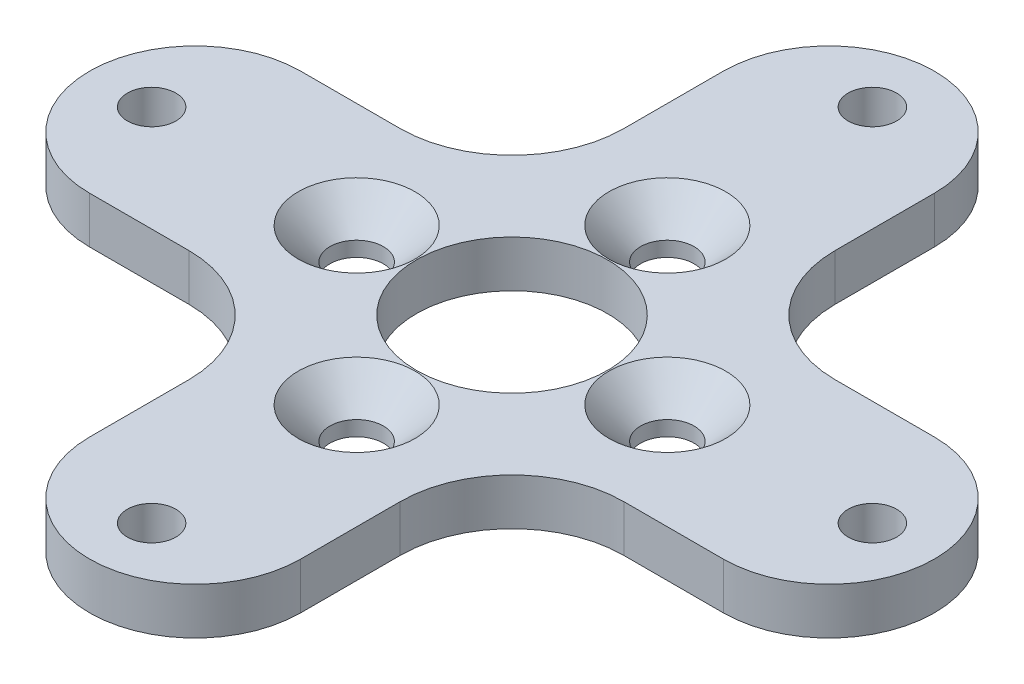
ISO-10303-21;
HEADER;
FILE_DESCRIPTION(('STEP AP214'),'2;1');
FILE_NAME('part.step','',(''),(''),'','','');
FILE_SCHEMA(('AUTOMOTIVE_DESIGN { 1 0 10303 214 1 1 1 1 }'));
ENDSEC;
DATA;
#1=APPLICATION_CONTEXT('core data for automotive mechanical design processes');
#2=APPLICATION_PROTOCOL_DEFINITION('international standard','automotive_design',2000,#1);
#3=PRODUCT_CONTEXT('',#1,'mechanical');
#4=PRODUCT('Part','Part','',(#3));
#5=PRODUCT_RELATED_PRODUCT_CATEGORY('part','',(#4));
#6=PRODUCT_DEFINITION_FORMATION('','',#4);
#7=PRODUCT_DEFINITION_CONTEXT('part definition',#1,'design');
#8=PRODUCT_DEFINITION('design','',#6,#7);
#9=PRODUCT_DEFINITION_SHAPE('','',#8);
#10=(LENGTH_UNIT() NAMED_UNIT(*) SI_UNIT(.MILLI.,.METRE.));
#11=(NAMED_UNIT(*) PLANE_ANGLE_UNIT() SI_UNIT($,.RADIAN.));
#12=(NAMED_UNIT(*) SI_UNIT($,.STERADIAN.) SOLID_ANGLE_UNIT());
#13=UNCERTAINTY_MEASURE_WITH_UNIT(LENGTH_MEASURE(1.E-05),#10,'distance_accuracy_value','');
#14=(GEOMETRIC_REPRESENTATION_CONTEXT(3) GLOBAL_UNCERTAINTY_ASSIGNED_CONTEXT((#13)) GLOBAL_UNIT_ASSIGNED_CONTEXT((#10,
#11,#12)) REPRESENTATION_CONTEXT('',''));
#15=CARTESIAN_POINT('',(0.,0.,0.));
#16=DIRECTION('',(0.,0.,1.));
#17=DIRECTION('',(1.,0.,0.));
#18=AXIS2_PLACEMENT_3D('',#15,#16,#17);
#19=CARTESIAN_POINT('',(0.,3.75,-25.5));
#20=DIRECTION('',(0.,1.,0.));
#21=DIRECTION('',(0.,0.,1.));
#22=AXIS2_PLACEMENT_3D('',#19,#20,#21);
#23=PLANE('',#22);
#24=CARTESIAN_POINT('',(12.5,3.75,0.));
#25=DIRECTION('',(0.,1.,0.));
#26=DIRECTION('',(0.,0.,1.));
#27=AXIS2_PLACEMENT_3D('',#24,#25,#26);
#28=CIRCLE('',#27,4.7);
#29=CARTESIAN_POINT('',(12.5,3.75,4.7));
#30=VERTEX_POINT('',#29);
#31=EDGE_CURVE('E606',#30,#30,#28,.T.);
#32=ORIENTED_EDGE('',*,*,#31,.F.);
#33=EDGE_LOOP('',(#32));
#34=FACE_BOUND('',#33,.T.);
#35=CARTESIAN_POINT('',(0.,3.75,-12.5));
#36=DIRECTION('',(0.,1.,0.));
#37=DIRECTION('',(0.,0.,1.));
#38=AXIS2_PLACEMENT_3D('',#35,#36,#37);
#39=CIRCLE('',#38,4.7);
#40=CARTESIAN_POINT('',(0.,3.75,-7.8));
#41=VERTEX_POINT('',#40);
#42=EDGE_CURVE('E613',#41,#41,#39,.T.);
#43=ORIENTED_EDGE('',*,*,#42,.F.);
#44=EDGE_LOOP('',(#43));
#45=FACE_BOUND('',#44,.T.);
#46=CARTESIAN_POINT('',(0.,3.75,12.5));
#47=DIRECTION('',(0.,1.,0.));
#48=DIRECTION('',(0.,0.,1.));
#49=AXIS2_PLACEMENT_3D('',#46,#47,#48);
#50=CIRCLE('',#49,4.7);
#51=CARTESIAN_POINT('',(0.,3.75,17.2));
#52=VERTEX_POINT('',#51);
#53=EDGE_CURVE('E622',#52,#52,#50,.T.);
#54=ORIENTED_EDGE('',*,*,#53,.F.);
#55=EDGE_LOOP('',(#54));
#56=FACE_BOUND('',#55,.T.);
#57=CARTESIAN_POINT('',(-12.5,3.75,0.));
#58=DIRECTION('',(0.,1.,0.));
#59=DIRECTION('',(0.,0.,1.));
#60=AXIS2_PLACEMENT_3D('',#57,#58,#59);
#61=CIRCLE('',#60,4.7);
#62=CARTESIAN_POINT('',(-12.5,3.75,4.7));
#63=VERTEX_POINT('',#62);
#64=EDGE_CURVE('E631',#63,#63,#61,.T.);
#65=ORIENTED_EDGE('',*,*,#64,.F.);
#66=EDGE_LOOP('',(#65));
#67=FACE_BOUND('',#66,.T.);
#68=CARTESIAN_POINT('',(1.64196851892795E-12,3.75,29.));
#69=DIRECTION('',(0.,1.,0.));
#70=DIRECTION('',(0.,0.,1.));
#71=AXIS2_PLACEMENT_3D('',#68,#69,#70);
#72=CIRCLE('',#71,1.95000000000176);
#73=CARTESIAN_POINT('',(1.64196851892795E-12,3.75,30.9500000000018));
#74=VERTEX_POINT('',#73);
#75=EDGE_CURVE('E647',#74,#74,#72,.T.);
#76=ORIENTED_EDGE('',*,*,#75,.F.);
#77=EDGE_LOOP('',(#76));
#78=FACE_BOUND('',#77,.T.);
#79=CARTESIAN_POINT('',(0.,3.75,-29.));
#80=DIRECTION('',(0.,1.,0.));
#81=DIRECTION('',(0.,0.,1.));
#82=AXIS2_PLACEMENT_3D('',#79,#80,#81);
#83=CIRCLE('',#82,1.95);
#84=CARTESIAN_POINT('',(0.,3.75,-27.05));
#85=VERTEX_POINT('',#84);
#86=EDGE_CURVE('E659',#85,#85,#83,.T.);
#87=ORIENTED_EDGE('',*,*,#86,.F.);
#88=EDGE_LOOP('',(#87));
#89=FACE_BOUND('',#88,.T.);
#90=DIRECTION('',(0.,0.,1.));
#91=VECTOR('',#90,1.);
#92=CARTESIAN_POINT('',(-8.49999999999999,3.75,-25.5));
#93=LINE('',#92,#91);
#94=CARTESIAN_POINT('',(-8.49999999999999,3.75,-25.5));
#95=VERTEX_POINT('',#94);
#96=CARTESIAN_POINT('',(-8.49999999999999,3.75,-17.5));
#97=VERTEX_POINT('',#96);
#98=EDGE_CURVE('E248',#95,#97,#93,.T.);
#99=ORIENTED_EDGE('',*,*,#98,.T.);
#100=CARTESIAN_POINT('',(-17.5,3.75,-17.5));
#101=DIRECTION('',(0.,1.,0.));
#102=DIRECTION('',(0.,0.,1.));
#103=AXIS2_PLACEMENT_3D('',#100,#101,#102);
#104=CIRCLE('',#103,9.);
#105=CARTESIAN_POINT('',(-17.5,3.75,-8.5));
#106=VERTEX_POINT('',#105);
#107=EDGE_CURVE('E11',#97,#106,#104,.F.);
#108=ORIENTED_EDGE('',*,*,#107,.T.);
#109=DIRECTION('',(-1.,0.,0.));
#110=VECTOR('',#109,1.);
#111=CARTESIAN_POINT('',(-25.5,3.75,-8.5));
#112=LINE('',#111,#110);
#113=CARTESIAN_POINT('',(-25.5,3.75,-8.5));
#114=VERTEX_POINT('',#113);
#115=EDGE_CURVE('E144',#106,#114,#112,.T.);
#116=ORIENTED_EDGE('',*,*,#115,.T.);
#117=CARTESIAN_POINT('',(-25.5,3.75,0.));
#118=DIRECTION('',(0.,1.,0.));
#119=DIRECTION('',(0.,0.,1.));
#120=AXIS2_PLACEMENT_3D('',#117,#118,#119);
#121=CIRCLE('',#120,8.5);
#122=CARTESIAN_POINT('',(-25.5,3.75,8.5));
#123=VERTEX_POINT('',#122);
#124=EDGE_CURVE('E148',#114,#123,#121,.T.);
#125=ORIENTED_EDGE('',*,*,#124,.T.);
#126=DIRECTION('',(1.,0.,0.));
#127=VECTOR('',#126,1.);
#128=CARTESIAN_POINT('',(-25.5,3.75,8.5));
#129=LINE('',#128,#127);
#130=CARTESIAN_POINT('',(-17.5,3.75,8.5));
#131=VERTEX_POINT('',#130);
#132=EDGE_CURVE('E164',#123,#131,#129,.T.);
#133=ORIENTED_EDGE('',*,*,#132,.T.);
#134=CARTESIAN_POINT('',(-17.5,3.75,17.5));
#135=DIRECTION('',(0.,1.,0.));
#136=DIRECTION('',(0.,0.,1.));
#137=AXIS2_PLACEMENT_3D('',#134,#135,#136);
#138=CIRCLE('',#137,9.);
#139=CARTESIAN_POINT('',(-8.49999999999999,3.75,17.5));
#140=VERTEX_POINT('',#139);
#141=EDGE_CURVE('E194',#131,#140,#138,.F.);
#142=ORIENTED_EDGE('',*,*,#141,.T.);
#143=DIRECTION('',(0.,0.,1.));
#144=VECTOR('',#143,1.);
#145=CARTESIAN_POINT('',(-8.49999999999999,3.75,8.5));
#146=LINE('',#145,#144);
#147=CARTESIAN_POINT('',(-8.49999999999999,3.75,25.5));
#148=VERTEX_POINT('',#147);
#149=EDGE_CURVE('E308',#140,#148,#146,.T.);
#150=ORIENTED_EDGE('',*,*,#149,.T.);
#151=CARTESIAN_POINT('',(0.,3.75,25.5));
#152=DIRECTION('',(0.,1.,0.));
#153=DIRECTION('',(0.,0.,1.));
#154=AXIS2_PLACEMENT_3D('',#151,#152,#153);
#155=CIRCLE('',#154,8.5);
#156=CARTESIAN_POINT('',(8.50000000000001,3.75,25.5));
#157=VERTEX_POINT('',#156);
#158=EDGE_CURVE('E264',#148,#157,#155,.T.);
#159=ORIENTED_EDGE('',*,*,#158,.T.);
#160=DIRECTION('',(0.,0.,-1.));
#161=VECTOR('',#160,1.);
#162=CARTESIAN_POINT('',(8.50000000000001,3.75,8.5));
#163=LINE('',#162,#161);
#164=CARTESIAN_POINT('',(8.50000000000001,3.75,17.5));
#165=VERTEX_POINT('',#164);
#166=EDGE_CURVE('E290',#157,#165,#163,.T.);
#167=ORIENTED_EDGE('',*,*,#166,.T.);
#168=CARTESIAN_POINT('',(17.5,3.75,17.5));
#169=DIRECTION('',(0.,1.,0.));
#170=DIRECTION('',(0.,0.,1.));
#171=AXIS2_PLACEMENT_3D('',#168,#169,#170);
#172=CIRCLE('',#171,9.);
#173=CARTESIAN_POINT('',(17.5,3.75,8.5));
#174=VERTEX_POINT('',#173);
#175=EDGE_CURVE('E198',#165,#174,#172,.F.);
#176=ORIENTED_EDGE('',*,*,#175,.T.);
#177=DIRECTION('',(1.,0.,0.));
#178=VECTOR('',#177,1.);
#179=CARTESIAN_POINT('',(8.50000000000001,3.75,8.5));
#180=LINE('',#179,#178);
#181=CARTESIAN_POINT('',(25.5,3.75,8.5));
#182=VERTEX_POINT('',#181);
#183=EDGE_CURVE('E287',#174,#182,#180,.T.);
#184=ORIENTED_EDGE('',*,*,#183,.T.);
#185=CARTESIAN_POINT('',(25.5,3.75,0.));
#186=DIRECTION('',(0.,1.,0.));
#187=DIRECTION('',(0.,0.,1.));
#188=AXIS2_PLACEMENT_3D('',#185,#186,#187);
#189=CIRCLE('',#188,8.5);
#190=CARTESIAN_POINT('',(25.5,3.75,-8.5));
#191=VERTEX_POINT('',#190);
#192=EDGE_CURVE('E286',#182,#191,#189,.T.);
#193=ORIENTED_EDGE('',*,*,#192,.T.);
#194=DIRECTION('',(-1.,0.,0.));
#195=VECTOR('',#194,1.);
#196=CARTESIAN_POINT('',(8.50000000000001,3.75,-8.5));
#197=LINE('',#196,#195);
#198=CARTESIAN_POINT('',(17.5,3.75,-8.5));
#199=VERTEX_POINT('',#198);
#200=EDGE_CURVE('E209',#191,#199,#197,.T.);
#201=ORIENTED_EDGE('',*,*,#200,.T.);
#202=CARTESIAN_POINT('',(17.5,3.75,-17.5));
#203=DIRECTION('',(0.,1.,0.));
#204=DIRECTION('',(0.,0.,1.));
#205=AXIS2_PLACEMENT_3D('',#202,#203,#204);
#206=CIRCLE('',#205,9.);
#207=CARTESIAN_POINT('',(8.50000000000001,3.75,-17.5));
#208=VERTEX_POINT('',#207);
#209=EDGE_CURVE('E202',#199,#208,#206,.F.);
#210=ORIENTED_EDGE('',*,*,#209,.T.);
#211=DIRECTION('',(0.,0.,-1.));
#212=VECTOR('',#211,1.);
#213=CARTESIAN_POINT('',(8.50000000000001,3.75,-25.5));
#214=LINE('',#213,#212);
#215=CARTESIAN_POINT('',(8.5,3.75,-25.5));
#216=VERTEX_POINT('',#215);
#217=EDGE_CURVE('E206',#208,#216,#214,.T.);
#218=ORIENTED_EDGE('',*,*,#217,.T.);
#219=CARTESIAN_POINT('',(0.,3.75,-25.5));
#220=DIRECTION('',(0.,1.,0.));
#221=DIRECTION('',(0.,0.,1.));
#222=AXIS2_PLACEMENT_3D('',#219,#220,#221);
#223=CIRCLE('',#222,8.5);
#224=EDGE_CURVE('E219',#216,#95,#223,.T.);
#225=ORIENTED_EDGE('',*,*,#224,.T.);
#226=EDGE_LOOP('',(#99,#108,#116,#125,#133,#142,#150,#159,#167,#176,#184,#193,#201,#210,#218,#225));
#227=FACE_BOUND('',#226,.T.);
#228=CARTESIAN_POINT('',(0.,3.75,0.));
#229=DIRECTION('',(0.,1.,0.));
#230=DIRECTION('',(0.,0.,1.));
#231=AXIS2_PLACEMENT_3D('',#228,#229,#230);
#232=CIRCLE('',#231,7.7);
#233=CARTESIAN_POINT('',(0.,3.75,7.7));
#234=VERTEX_POINT('',#233);
#235=EDGE_CURVE('E298',#234,#234,#232,.T.);
#236=ORIENTED_EDGE('',*,*,#235,.F.);
#237=EDGE_LOOP('',(#236));
#238=FACE_BOUND('',#237,.T.);
#239=CARTESIAN_POINT('',(29.0000000000008,3.75,-8.20678097764189E-13));
#240=DIRECTION('',(0.,1.,0.));
#241=DIRECTION('',(0.,0.,1.));
#242=AXIS2_PLACEMENT_3D('',#239,#240,#241);
#243=CIRCLE('',#242,1.95000000000064);
#244=CARTESIAN_POINT('',(29.0000000000008,3.75,1.94999999999982));
#245=VERTEX_POINT('',#244);
#246=EDGE_CURVE('E653',#245,#245,#243,.T.);
#247=ORIENTED_EDGE('',*,*,#246,.F.);
#248=EDGE_LOOP('',(#247));
#249=FACE_BOUND('',#248,.T.);
#250=CARTESIAN_POINT('',(-28.9999999999992,3.75,8.24229573481716E-13));
#251=DIRECTION('',(0.,1.,0.));
#252=DIRECTION('',(0.,0.,1.));
#253=AXIS2_PLACEMENT_3D('',#250,#251,#252);
#254=CIRCLE('',#253,1.95000000000132);
#255=CARTESIAN_POINT('',(-28.9999999999992,3.75,1.95000000000214));
#256=VERTEX_POINT('',#255);
#257=EDGE_CURVE('E641',#256,#256,#254,.T.);
#258=ORIENTED_EDGE('',*,*,#257,.F.);
#259=EDGE_LOOP('',(#258));
#260=FACE_BOUND('',#259,.T.);
#261=ADVANCED_FACE('F32',(#34,#45,#56,#67,#78,#89,#227,#238,#249,#260),#23,.T.);
#262=CARTESIAN_POINT('',(0.,0.,-25.5));
#263=DIRECTION('',(0.,1.,0.));
#264=DIRECTION('',(0.,0.,1.));
#265=AXIS2_PLACEMENT_3D('',#262,#263,#264);
#266=PLANE('',#265);
#267=CARTESIAN_POINT('',(12.5,0.,0.));
#268=DIRECTION('',(0.,1.,0.));
#269=DIRECTION('',(0.,0.,1.));
#270=AXIS2_PLACEMENT_3D('',#267,#268,#269);
#271=CIRCLE('',#270,2.15);
#272=CARTESIAN_POINT('',(12.5,0.,2.15));
#273=VERTEX_POINT('',#272);
#274=EDGE_CURVE('E608',#273,#273,#271,.T.);
#275=ORIENTED_EDGE('',*,*,#274,.T.);
#276=EDGE_LOOP('',(#275));
#277=FACE_BOUND('',#276,.T.);
#278=CARTESIAN_POINT('',(0.,0.,-12.5));
#279=DIRECTION('',(0.,1.,0.));
#280=DIRECTION('',(0.,0.,1.));
#281=AXIS2_PLACEMENT_3D('',#278,#279,#280);
#282=CIRCLE('',#281,2.15);
#283=CARTESIAN_POINT('',(0.,0.,-10.35));
#284=VERTEX_POINT('',#283);
#285=EDGE_CURVE('E619',#284,#284,#282,.T.);
#286=ORIENTED_EDGE('',*,*,#285,.T.);
#287=EDGE_LOOP('',(#286));
#288=FACE_BOUND('',#287,.T.);
#289=CARTESIAN_POINT('',(0.,0.,12.5));
#290=DIRECTION('',(0.,1.,0.));
#291=DIRECTION('',(0.,0.,1.));
#292=AXIS2_PLACEMENT_3D('',#289,#290,#291);
#293=CIRCLE('',#292,2.15);
#294=CARTESIAN_POINT('',(0.,0.,14.65));
#295=VERTEX_POINT('',#294);
#296=EDGE_CURVE('E628',#295,#295,#293,.T.);
#297=ORIENTED_EDGE('',*,*,#296,.T.);
#298=EDGE_LOOP('',(#297));
#299=FACE_BOUND('',#298,.T.);
#300=CARTESIAN_POINT('',(-12.5,0.,0.));
#301=DIRECTION('',(0.,1.,0.));
#302=DIRECTION('',(0.,0.,1.));
#303=AXIS2_PLACEMENT_3D('',#300,#301,#302);
#304=CIRCLE('',#303,2.15);
#305=CARTESIAN_POINT('',(-12.5,0.,2.15));
#306=VERTEX_POINT('',#305);
#307=EDGE_CURVE('E637',#306,#306,#304,.T.);
#308=ORIENTED_EDGE('',*,*,#307,.T.);
#309=EDGE_LOOP('',(#308));
#310=FACE_BOUND('',#309,.T.);
#311=DIRECTION('',(-1.,0.,0.));
#312=VECTOR('',#311,1.);
#313=CARTESIAN_POINT('',(-25.5,0.,-8.5));
#314=LINE('',#313,#312);
#315=CARTESIAN_POINT('',(-17.5,0.,-8.5));
#316=VERTEX_POINT('',#315);
#317=CARTESIAN_POINT('',(-25.5,0.,-8.5));
#318=VERTEX_POINT('',#317);
#319=EDGE_CURVE('E167',#316,#318,#314,.T.);
#320=ORIENTED_EDGE('',*,*,#319,.F.);
#321=CARTESIAN_POINT('',(-17.5,0.,-17.5));
#322=DIRECTION('',(0.,1.,0.));
#323=DIRECTION('',(0.,0.,1.));
#324=AXIS2_PLACEMENT_3D('',#321,#322,#323);
#325=CIRCLE('',#324,9.);
#326=CARTESIAN_POINT('',(-8.49999999999999,0.,-17.5));
#327=VERTEX_POINT('',#326);
#328=EDGE_CURVE('E40',#316,#327,#325,.T.);
#329=ORIENTED_EDGE('',*,*,#328,.T.);
#330=DIRECTION('',(0.,0.,1.));
#331=VECTOR('',#330,1.);
#332=CARTESIAN_POINT('',(-8.49999999999999,0.,-25.5));
#333=LINE('',#332,#331);
#334=CARTESIAN_POINT('',(-8.49999999999999,0.,-25.5));
#335=VERTEX_POINT('',#334);
#336=EDGE_CURVE('E155',#335,#327,#333,.T.);
#337=ORIENTED_EDGE('',*,*,#336,.F.);
#338=CARTESIAN_POINT('',(0.,0.,-25.5));
#339=DIRECTION('',(0.,1.,0.));
#340=DIRECTION('',(0.,0.,1.));
#341=AXIS2_PLACEMENT_3D('',#338,#339,#340);
#342=CIRCLE('',#341,8.5);
#343=CARTESIAN_POINT('',(8.5,0.,-25.5));
#344=VERTEX_POINT('',#343);
#345=EDGE_CURVE('E237',#344,#335,#342,.T.);
#346=ORIENTED_EDGE('',*,*,#345,.F.);
#347=DIRECTION('',(0.,0.,-1.));
#348=VECTOR('',#347,1.);
#349=CARTESIAN_POINT('',(8.50000000000001,0.,-25.5));
#350=LINE('',#349,#348);
#351=CARTESIAN_POINT('',(8.50000000000001,0.,-17.5));
#352=VERTEX_POINT('',#351);
#353=EDGE_CURVE('E229',#352,#344,#350,.T.);
#354=ORIENTED_EDGE('',*,*,#353,.F.);
#355=CARTESIAN_POINT('',(17.5,0.,-17.5));
#356=DIRECTION('',(0.,1.,0.));
#357=DIRECTION('',(0.,0.,1.));
#358=AXIS2_PLACEMENT_3D('',#355,#356,#357);
#359=CIRCLE('',#358,9.);
#360=CARTESIAN_POINT('',(17.5,0.,-8.5));
#361=VERTEX_POINT('',#360);
#362=EDGE_CURVE('E200',#352,#361,#359,.T.);
#363=ORIENTED_EDGE('',*,*,#362,.T.);
#364=DIRECTION('',(-1.,0.,0.));
#365=VECTOR('',#364,1.);
#366=CARTESIAN_POINT('',(8.50000000000001,0.,-8.5));
#367=LINE('',#366,#365);
#368=CARTESIAN_POINT('',(25.5,0.,-8.5));
#369=VERTEX_POINT('',#368);
#370=EDGE_CURVE('E227',#369,#361,#367,.T.);
#371=ORIENTED_EDGE('',*,*,#370,.F.);
#372=CARTESIAN_POINT('',(25.5,0.,0.));
#373=DIRECTION('',(0.,1.,0.));
#374=DIRECTION('',(0.,0.,1.));
#375=AXIS2_PLACEMENT_3D('',#372,#373,#374);
#376=CIRCLE('',#375,8.5);
#377=CARTESIAN_POINT('',(25.5,0.,8.5));
#378=VERTEX_POINT('',#377);
#379=EDGE_CURVE('E235',#378,#369,#376,.T.);
#380=ORIENTED_EDGE('',*,*,#379,.F.);
#381=DIRECTION('',(1.,0.,0.));
#382=VECTOR('',#381,1.);
#383=CARTESIAN_POINT('',(8.50000000000001,0.,8.5));
#384=LINE('',#383,#382);
#385=CARTESIAN_POINT('',(17.5,0.,8.5));
#386=VERTEX_POINT('',#385);
#387=EDGE_CURVE('E239',#386,#378,#384,.T.);
#388=ORIENTED_EDGE('',*,*,#387,.F.);
#389=CARTESIAN_POINT('',(17.5,0.,17.5));
#390=DIRECTION('',(0.,1.,0.));
#391=DIRECTION('',(0.,0.,1.));
#392=AXIS2_PLACEMENT_3D('',#389,#390,#391);
#393=CIRCLE('',#392,9.);
#394=CARTESIAN_POINT('',(8.50000000000001,0.,17.5));
#395=VERTEX_POINT('',#394);
#396=EDGE_CURVE('E196',#386,#395,#393,.T.);
#397=ORIENTED_EDGE('',*,*,#396,.T.);
#398=DIRECTION('',(0.,0.,-1.));
#399=VECTOR('',#398,1.);
#400=CARTESIAN_POINT('',(8.50000000000001,0.,8.5));
#401=LINE('',#400,#399);
#402=CARTESIAN_POINT('',(8.50000000000001,0.,25.5));
#403=VERTEX_POINT('',#402);
#404=EDGE_CURVE('E271',#403,#395,#401,.T.);
#405=ORIENTED_EDGE('',*,*,#404,.F.);
#406=CARTESIAN_POINT('',(0.,0.,25.5));
#407=DIRECTION('',(0.,1.,0.));
#408=DIRECTION('',(0.,0.,1.));
#409=AXIS2_PLACEMENT_3D('',#406,#407,#408);
#410=CIRCLE('',#409,8.5);
#411=CARTESIAN_POINT('',(-8.49999999999999,0.,25.5));
#412=VERTEX_POINT('',#411);
#413=EDGE_CURVE('E263',#412,#403,#410,.T.);
#414=ORIENTED_EDGE('',*,*,#413,.F.);
#415=DIRECTION('',(0.,0.,1.));
#416=VECTOR('',#415,1.);
#417=CARTESIAN_POINT('',(-8.49999999999999,0.,8.5));
#418=LINE('',#417,#416);
#419=CARTESIAN_POINT('',(-8.49999999999999,0.,17.5));
#420=VERTEX_POINT('',#419);
#421=EDGE_CURVE('E269',#420,#412,#418,.T.);
#422=ORIENTED_EDGE('',*,*,#421,.F.);
#423=CARTESIAN_POINT('',(-17.5,0.,17.5));
#424=DIRECTION('',(0.,1.,0.));
#425=DIRECTION('',(0.,0.,1.));
#426=AXIS2_PLACEMENT_3D('',#423,#424,#425);
#427=CIRCLE('',#426,9.);
#428=CARTESIAN_POINT('',(-17.5,0.,8.5));
#429=VERTEX_POINT('',#428);
#430=EDGE_CURVE('E192',#420,#429,#427,.T.);
#431=ORIENTED_EDGE('',*,*,#430,.T.);
#432=DIRECTION('',(1.,0.,0.));
#433=VECTOR('',#432,1.);
#434=CARTESIAN_POINT('',(-25.5,0.,8.5));
#435=LINE('',#434,#433);
#436=CARTESIAN_POINT('',(-25.5,0.,8.5));
#437=VERTEX_POINT('',#436);
#438=EDGE_CURVE('E274',#437,#429,#435,.T.);
#439=ORIENTED_EDGE('',*,*,#438,.F.);
#440=CARTESIAN_POINT('',(-25.5,0.,0.));
#441=DIRECTION('',(0.,1.,0.));
#442=DIRECTION('',(0.,0.,1.));
#443=AXIS2_PLACEMENT_3D('',#440,#441,#442);
#444=CIRCLE('',#443,8.5);
#445=EDGE_CURVE('E297',#318,#437,#444,.T.);
#446=ORIENTED_EDGE('',*,*,#445,.F.);
#447=EDGE_LOOP('',(#320,#329,#337,#346,#354,#363,#371,#380,#388,#397,#405,#414,#422,#431,#439,#446));
#448=FACE_BOUND('',#447,.T.);
#449=CARTESIAN_POINT('',(0.,0.,0.));
#450=DIRECTION('',(0.,1.,0.));
#451=DIRECTION('',(0.,0.,1.));
#452=AXIS2_PLACEMENT_3D('',#449,#450,#451);
#453=CIRCLE('',#452,7.7);
#454=CARTESIAN_POINT('',(0.,0.,7.7));
#455=VERTEX_POINT('',#454);
#456=EDGE_CURVE('E662',#455,#455,#453,.T.);
#457=ORIENTED_EDGE('',*,*,#456,.T.);
#458=EDGE_LOOP('',(#457));
#459=FACE_BOUND('',#458,.T.);
#460=CARTESIAN_POINT('',(0.,0.,-29.));
#461=DIRECTION('',(0.,1.,0.));
#462=DIRECTION('',(0.,0.,1.));
#463=AXIS2_PLACEMENT_3D('',#460,#461,#462);
#464=CIRCLE('',#463,1.95);
#465=CARTESIAN_POINT('',(0.,0.,-27.05));
#466=VERTEX_POINT('',#465);
#467=EDGE_CURVE('E656',#466,#466,#464,.T.);
#468=ORIENTED_EDGE('',*,*,#467,.T.);
#469=EDGE_LOOP('',(#468));
#470=FACE_BOUND('',#469,.T.);
#471=CARTESIAN_POINT('',(29.0000000000008,0.,-8.20678097764189E-13));
#472=DIRECTION('',(0.,1.,0.));
#473=DIRECTION('',(0.,0.,1.));
#474=AXIS2_PLACEMENT_3D('',#471,#472,#473);
#475=CIRCLE('',#474,1.95000000000064);
#476=CARTESIAN_POINT('',(29.0000000000008,0.,1.94999999999982));
#477=VERTEX_POINT('',#476);
#478=EDGE_CURVE('E650',#477,#477,#475,.T.);
#479=ORIENTED_EDGE('',*,*,#478,.T.);
#480=EDGE_LOOP('',(#479));
#481=FACE_BOUND('',#480,.T.);
#482=CARTESIAN_POINT('',(1.64196851892795E-12,0.,29.));
#483=DIRECTION('',(0.,1.,0.));
#484=DIRECTION('',(0.,0.,1.));
#485=AXIS2_PLACEMENT_3D('',#482,#483,#484);
#486=CIRCLE('',#485,1.95000000000176);
#487=CARTESIAN_POINT('',(1.64196851892795E-12,0.,30.9500000000018));
#488=VERTEX_POINT('',#487);
#489=EDGE_CURVE('E644',#488,#488,#486,.T.);
#490=ORIENTED_EDGE('',*,*,#489,.T.);
#491=EDGE_LOOP('',(#490));
#492=FACE_BOUND('',#491,.T.);
#493=CARTESIAN_POINT('',(-28.9999999999992,0.,8.24229573481716E-13));
#494=DIRECTION('',(0.,1.,0.));
#495=DIRECTION('',(0.,0.,1.));
#496=AXIS2_PLACEMENT_3D('',#493,#494,#495);
#497=CIRCLE('',#496,1.95000000000132);
#498=CARTESIAN_POINT('',(-28.9999999999992,0.,1.95000000000214));
#499=VERTEX_POINT('',#498);
#500=EDGE_CURVE('E640',#499,#499,#497,.T.);
#501=ORIENTED_EDGE('',*,*,#500,.T.);
#502=EDGE_LOOP('',(#501));
#503=FACE_BOUND('',#502,.T.);
#504=ADVANCED_FACE('F224',(#277,#288,#299,#310,#448,#459,#470,#481,#492,#503),#266,.F.);
#505=CARTESIAN_POINT('',(-25.5,3.75,-8.5));
#506=DIRECTION('',(0.,0.,1.));
#507=DIRECTION('',(1.,0.,0.));
#508=AXIS2_PLACEMENT_3D('',#505,#506,#507);
#509=PLANE('',#508);
#510=ORIENTED_EDGE('',*,*,#115,.F.);
#511=DIRECTION('',(0.,-1.,0.));
#512=VECTOR('',#511,1.);
#513=CARTESIAN_POINT('',(-17.5,0.,-8.5));
#514=LINE('',#513,#512);
#515=EDGE_CURVE('E189',#106,#316,#514,.T.);
#516=ORIENTED_EDGE('',*,*,#515,.T.);
#517=ORIENTED_EDGE('',*,*,#319,.T.);
#518=DIRECTION('',(0.,-1.,0.));
#519=VECTOR('',#518,1.);
#520=CARTESIAN_POINT('',(-25.5,3.75,-8.5));
#521=LINE('',#520,#519);
#522=EDGE_CURVE('E160',#114,#318,#521,.T.);
#523=ORIENTED_EDGE('',*,*,#522,.F.);
#524=EDGE_LOOP('',(#510,#516,#517,#523));
#525=FACE_BOUND('',#524,.T.);
#526=ADVANCED_FACE('F166',(#525),#509,.F.);
#527=CARTESIAN_POINT('',(-25.5,3.75,0.));
#528=DIRECTION('',(0.,-1.,0.));
#529=DIRECTION('',(0.,0.,-1.));
#530=AXIS2_PLACEMENT_3D('',#527,#528,#529);
#531=CYLINDRICAL_SURFACE('',#530,8.5);
#532=ORIENTED_EDGE('',*,*,#445,.T.);
#533=DIRECTION('',(0.,-1.,0.));
#534=VECTOR('',#533,1.);
#535=CARTESIAN_POINT('',(-25.5,3.75,8.5));
#536=LINE('',#535,#534);
#537=EDGE_CURVE('E162',#123,#437,#536,.T.);
#538=ORIENTED_EDGE('',*,*,#537,.F.);
#539=ORIENTED_EDGE('',*,*,#124,.F.);
#540=ORIENTED_EDGE('',*,*,#522,.T.);
#541=EDGE_LOOP('',(#532,#538,#539,#540));
#542=FACE_BOUND('',#541,.T.);
#543=ADVANCED_FACE('F159',(#542),#531,.T.);
#544=CARTESIAN_POINT('',(-25.5,3.75,8.5));
#545=DIRECTION('',(0.,0.,-1.));
#546=DIRECTION('',(-1.,0.,0.));
#547=AXIS2_PLACEMENT_3D('',#544,#545,#546);
#548=PLANE('',#547);
#549=ORIENTED_EDGE('',*,*,#438,.T.);
#550=DIRECTION('',(0.,-1.,0.));
#551=VECTOR('',#550,1.);
#552=CARTESIAN_POINT('',(-17.5,3.75,8.5));
#553=LINE('',#552,#551);
#554=EDGE_CURVE('E172',#429,#131,#553,.F.);
#555=ORIENTED_EDGE('',*,*,#554,.T.);
#556=ORIENTED_EDGE('',*,*,#132,.F.);
#557=ORIENTED_EDGE('',*,*,#537,.T.);
#558=EDGE_LOOP('',(#549,#555,#556,#557));
#559=FACE_BOUND('',#558,.T.);
#560=ADVANCED_FACE('F303',(#559),#548,.F.);
#561=CARTESIAN_POINT('',(-8.49999999999999,3.75,8.5));
#562=DIRECTION('',(1.,0.,0.));
#563=DIRECTION('',(0.,0.,-1.));
#564=AXIS2_PLACEMENT_3D('',#561,#562,#563);
#565=PLANE('',#564);
#566=ORIENTED_EDGE('',*,*,#149,.F.);
#567=DIRECTION('',(0.,-1.,0.));
#568=VECTOR('',#567,1.);
#569=CARTESIAN_POINT('',(-8.49999999999999,0.,17.5));
#570=LINE('',#569,#568);
#571=EDGE_CURVE('E169',#140,#420,#570,.T.);
#572=ORIENTED_EDGE('',*,*,#571,.T.);
#573=ORIENTED_EDGE('',*,*,#421,.T.);
#574=DIRECTION('',(0.,-1.,0.));
#575=VECTOR('',#574,1.);
#576=CARTESIAN_POINT('',(-8.49999999999999,3.75,25.5));
#577=LINE('',#576,#575);
#578=EDGE_CURVE('E174',#148,#412,#577,.T.);
#579=ORIENTED_EDGE('',*,*,#578,.F.);
#580=EDGE_LOOP('',(#566,#572,#573,#579));
#581=FACE_BOUND('',#580,.T.);
#582=ADVANCED_FACE('F309',(#581),#565,.F.);
#583=CARTESIAN_POINT('',(0.,3.75,25.5));
#584=DIRECTION('',(0.,-1.,0.));
#585=DIRECTION('',(0.,0.,-1.));
#586=AXIS2_PLACEMENT_3D('',#583,#584,#585);
#587=CYLINDRICAL_SURFACE('',#586,8.5);
#588=ORIENTED_EDGE('',*,*,#413,.T.);
#589=DIRECTION('',(0.,-1.,0.));
#590=VECTOR('',#589,1.);
#591=CARTESIAN_POINT('',(8.50000000000001,3.75,25.5));
#592=LINE('',#591,#590);
#593=EDGE_CURVE('E254',#157,#403,#592,.T.);
#594=ORIENTED_EDGE('',*,*,#593,.F.);
#595=ORIENTED_EDGE('',*,*,#158,.F.);
#596=ORIENTED_EDGE('',*,*,#578,.T.);
#597=EDGE_LOOP('',(#588,#594,#595,#596));
#598=FACE_BOUND('',#597,.T.);
#599=ADVANCED_FACE('F261',(#598),#587,.T.);
#600=CARTESIAN_POINT('',(8.50000000000001,3.75,8.5));
#601=DIRECTION('',(-1.,0.,0.));
#602=DIRECTION('',(0.,0.,1.));
#603=AXIS2_PLACEMENT_3D('',#600,#601,#602);
#604=PLANE('',#603);
#605=ORIENTED_EDGE('',*,*,#404,.T.);
#606=DIRECTION('',(0.,-1.,0.));
#607=VECTOR('',#606,1.);
#608=CARTESIAN_POINT('',(8.50000000000001,3.75,17.5));
#609=LINE('',#608,#607);
#610=EDGE_CURVE('E182',#395,#165,#609,.F.);
#611=ORIENTED_EDGE('',*,*,#610,.T.);
#612=ORIENTED_EDGE('',*,*,#166,.F.);
#613=ORIENTED_EDGE('',*,*,#593,.T.);
#614=EDGE_LOOP('',(#605,#611,#612,#613));
#615=FACE_BOUND('',#614,.T.);
#616=ADVANCED_FACE('F320',(#615),#604,.F.);
#617=CARTESIAN_POINT('',(8.50000000000001,3.75,8.5));
#618=DIRECTION('',(0.,0.,-1.));
#619=DIRECTION('',(-1.,0.,0.));
#620=AXIS2_PLACEMENT_3D('',#617,#618,#619);
#621=PLANE('',#620);
#622=ORIENTED_EDGE('',*,*,#183,.F.);
#623=DIRECTION('',(0.,-1.,0.));
#624=VECTOR('',#623,1.);
#625=CARTESIAN_POINT('',(17.5,0.,8.5));
#626=LINE('',#625,#624);
#627=EDGE_CURVE('E179',#174,#386,#626,.T.);
#628=ORIENTED_EDGE('',*,*,#627,.T.);
#629=ORIENTED_EDGE('',*,*,#387,.T.);
#630=DIRECTION('',(0.,-1.,0.));
#631=VECTOR('',#630,1.);
#632=CARTESIAN_POINT('',(25.5,3.75,8.5));
#633=LINE('',#632,#631);
#634=EDGE_CURVE('E251',#182,#378,#633,.T.);
#635=ORIENTED_EDGE('',*,*,#634,.F.);
#636=EDGE_LOOP('',(#622,#628,#629,#635));
#637=FACE_BOUND('',#636,.T.);
#638=ADVANCED_FACE('F281',(#637),#621,.F.);
#639=CARTESIAN_POINT('',(25.5,3.75,0.));
#640=DIRECTION('',(0.,-1.,0.));
#641=DIRECTION('',(0.,0.,-1.));
#642=AXIS2_PLACEMENT_3D('',#639,#640,#641);
#643=CYLINDRICAL_SURFACE('',#642,8.5);
#644=ORIENTED_EDGE('',*,*,#379,.T.);
#645=DIRECTION('',(0.,-1.,0.));
#646=VECTOR('',#645,1.);
#647=CARTESIAN_POINT('',(25.5,3.75,-8.5));
#648=LINE('',#647,#646);
#649=EDGE_CURVE('E234',#191,#369,#648,.T.);
#650=ORIENTED_EDGE('',*,*,#649,.F.);
#651=ORIENTED_EDGE('',*,*,#192,.F.);
#652=ORIENTED_EDGE('',*,*,#634,.T.);
#653=EDGE_LOOP('',(#644,#650,#651,#652));
#654=FACE_BOUND('',#653,.T.);
#655=ADVANCED_FACE('F285',(#654),#643,.T.);
#656=CARTESIAN_POINT('',(8.50000000000001,3.75,-8.5));
#657=DIRECTION('',(0.,0.,1.));
#658=DIRECTION('',(1.,0.,0.));
#659=AXIS2_PLACEMENT_3D('',#656,#657,#658);
#660=PLANE('',#659);
#661=ORIENTED_EDGE('',*,*,#370,.T.);
#662=DIRECTION('',(0.,-1.,0.));
#663=VECTOR('',#662,1.);
#664=CARTESIAN_POINT('',(17.5,3.75,-8.5));
#665=LINE('',#664,#663);
#666=EDGE_CURVE('E187',#361,#199,#665,.F.);
#667=ORIENTED_EDGE('',*,*,#666,.T.);
#668=ORIENTED_EDGE('',*,*,#200,.F.);
#669=ORIENTED_EDGE('',*,*,#649,.T.);
#670=EDGE_LOOP('',(#661,#667,#668,#669));
#671=FACE_BOUND('',#670,.T.);
#672=ADVANCED_FACE('F232',(#671),#660,.F.);
#673=CARTESIAN_POINT('',(8.50000000000001,3.75,-25.5));
#674=DIRECTION('',(-1.,0.,0.));
#675=DIRECTION('',(0.,0.,1.));
#676=AXIS2_PLACEMENT_3D('',#673,#674,#675);
#677=PLANE('',#676);
#678=ORIENTED_EDGE('',*,*,#217,.F.);
#679=DIRECTION('',(0.,-1.,0.));
#680=VECTOR('',#679,1.);
#681=CARTESIAN_POINT('',(8.50000000000001,0.,-17.5));
#682=LINE('',#681,#680);
#683=EDGE_CURVE('E184',#208,#352,#682,.T.);
#684=ORIENTED_EDGE('',*,*,#683,.T.);
#685=ORIENTED_EDGE('',*,*,#353,.T.);
#686=DIRECTION('',(0.,-1.,0.));
#687=VECTOR('',#686,1.);
#688=CARTESIAN_POINT('',(8.5,3.75,-25.5));
#689=LINE('',#688,#687);
#690=EDGE_CURVE('E217',#216,#344,#689,.T.);
#691=ORIENTED_EDGE('',*,*,#690,.F.);
#692=EDGE_LOOP('',(#678,#684,#685,#691));
#693=FACE_BOUND('',#692,.T.);
#694=ADVANCED_FACE('F214',(#693),#677,.F.);
#695=CARTESIAN_POINT('',(0.,3.75,-25.5));
#696=DIRECTION('',(0.,-1.,0.));
#697=DIRECTION('',(0.,0.,-1.));
#698=AXIS2_PLACEMENT_3D('',#695,#696,#697);
#699=CYLINDRICAL_SURFACE('',#698,8.5);
#700=ORIENTED_EDGE('',*,*,#345,.T.);
#701=DIRECTION('',(0.,-1.,0.));
#702=VECTOR('',#701,1.);
#703=CARTESIAN_POINT('',(-8.49999999999999,3.75,-25.5));
#704=LINE('',#703,#702);
#705=EDGE_CURVE('E245',#95,#335,#704,.T.);
#706=ORIENTED_EDGE('',*,*,#705,.F.);
#707=ORIENTED_EDGE('',*,*,#224,.F.);
#708=ORIENTED_EDGE('',*,*,#690,.T.);
#709=EDGE_LOOP('',(#700,#706,#707,#708));
#710=FACE_BOUND('',#709,.T.);
#711=ADVANCED_FACE('F346',(#710),#699,.T.);
#712=CARTESIAN_POINT('',(-8.49999999999999,3.75,-25.5));
#713=DIRECTION('',(1.,0.,0.));
#714=DIRECTION('',(0.,0.,-1.));
#715=AXIS2_PLACEMENT_3D('',#712,#713,#714);
#716=PLANE('',#715);
#717=ORIENTED_EDGE('',*,*,#336,.T.);
#718=DIRECTION('',(0.,-1.,0.));
#719=VECTOR('',#718,1.);
#720=CARTESIAN_POINT('',(-8.49999999999999,3.75,-17.5));
#721=LINE('',#720,#719);
#722=EDGE_CURVE('E47',#327,#97,#721,.F.);
#723=ORIENTED_EDGE('',*,*,#722,.T.);
#724=ORIENTED_EDGE('',*,*,#98,.F.);
#725=ORIENTED_EDGE('',*,*,#705,.T.);
#726=EDGE_LOOP('',(#717,#723,#724,#725));
#727=FACE_BOUND('',#726,.T.);
#728=ADVANCED_FACE('F343',(#727),#716,.F.);
#729=CARTESIAN_POINT('',(0.,3.75,0.));
#730=DIRECTION('',(0.,-1.,0.));
#731=DIRECTION('',(0.,0.,-1.));
#732=AXIS2_PLACEMENT_3D('',#729,#730,#731);
#733=CYLINDRICAL_SURFACE('',#732,7.7);
#734=ORIENTED_EDGE('',*,*,#235,.T.);
#735=EDGE_LOOP('',(#734));
#736=FACE_BOUND('',#735,.T.);
#737=ORIENTED_EDGE('',*,*,#456,.F.);
#738=EDGE_LOOP('',(#737));
#739=FACE_BOUND('',#738,.T.);
#740=ADVANCED_FACE('F340',(#736,#739),#733,.F.);
#741=CARTESIAN_POINT('',(0.,3.75,-29.));
#742=DIRECTION('',(0.,-1.,0.));
#743=DIRECTION('',(0.,0.,-1.));
#744=AXIS2_PLACEMENT_3D('',#741,#742,#743);
#745=CYLINDRICAL_SURFACE('',#744,1.95);
#746=ORIENTED_EDGE('',*,*,#86,.T.);
#747=EDGE_LOOP('',(#746));
#748=FACE_BOUND('',#747,.T.);
#749=ORIENTED_EDGE('',*,*,#467,.F.);
#750=EDGE_LOOP('',(#749));
#751=FACE_BOUND('',#750,.T.);
#752=ADVANCED_FACE('F383',(#748,#751),#745,.F.);
#753=CARTESIAN_POINT('',(29.0000000000008,3.75,-8.20678097764189E-13));
#754=DIRECTION('',(0.,-1.,0.));
#755=DIRECTION('',(0.,0.,-1.));
#756=AXIS2_PLACEMENT_3D('',#753,#754,#755);
#757=CYLINDRICAL_SURFACE('',#756,1.95000000000064);
#758=ORIENTED_EDGE('',*,*,#246,.T.);
#759=EDGE_LOOP('',(#758));
#760=FACE_BOUND('',#759,.T.);
#761=ORIENTED_EDGE('',*,*,#478,.F.);
#762=EDGE_LOOP('',(#761));
#763=FACE_BOUND('',#762,.T.);
#764=ADVANCED_FACE('F390',(#760,#763),#757,.F.);
#765=CARTESIAN_POINT('',(1.64196851892795E-12,3.75,29.));
#766=DIRECTION('',(0.,-1.,0.));
#767=DIRECTION('',(0.,0.,-1.));
#768=AXIS2_PLACEMENT_3D('',#765,#766,#767);
#769=CYLINDRICAL_SURFACE('',#768,1.95000000000176);
#770=ORIENTED_EDGE('',*,*,#75,.T.);
#771=EDGE_LOOP('',(#770));
#772=FACE_BOUND('',#771,.T.);
#773=ORIENTED_EDGE('',*,*,#489,.F.);
#774=EDGE_LOOP('',(#773));
#775=FACE_BOUND('',#774,.T.);
#776=ADVANCED_FACE('F397',(#772,#775),#769,.F.);
#777=CARTESIAN_POINT('',(-28.9999999999992,3.75,8.24229573481716E-13));
#778=DIRECTION('',(0.,-1.,0.));
#779=DIRECTION('',(0.,0.,-1.));
#780=AXIS2_PLACEMENT_3D('',#777,#778,#779);
#781=CYLINDRICAL_SURFACE('',#780,1.95000000000132);
#782=ORIENTED_EDGE('',*,*,#257,.T.);
#783=EDGE_LOOP('',(#782));
#784=FACE_BOUND('',#783,.T.);
#785=ORIENTED_EDGE('',*,*,#500,.F.);
#786=EDGE_LOOP('',(#785));
#787=FACE_BOUND('',#786,.T.);
#788=ADVANCED_FACE('F405',(#784,#787),#781,.F.);
#789=CARTESIAN_POINT('',(-17.5,3.75,17.5));
#790=DIRECTION('',(0.,1.,0.));
#791=DIRECTION('',(0.,0.,1.));
#792=AXIS2_PLACEMENT_3D('',#789,#790,#791);
#793=CYLINDRICAL_SURFACE('',#792,9.);
#794=ORIENTED_EDGE('',*,*,#141,.F.);
#795=ORIENTED_EDGE('',*,*,#554,.F.);
#796=ORIENTED_EDGE('',*,*,#430,.F.);
#797=ORIENTED_EDGE('',*,*,#571,.F.);
#798=EDGE_LOOP('',(#794,#795,#796,#797));
#799=FACE_BOUND('',#798,.T.);
#800=ADVANCED_FACE('F306',(#799),#793,.F.);
#801=CARTESIAN_POINT('',(17.5,3.75,17.5));
#802=DIRECTION('',(0.,1.,0.));
#803=DIRECTION('',(0.,0.,1.));
#804=AXIS2_PLACEMENT_3D('',#801,#802,#803);
#805=CYLINDRICAL_SURFACE('',#804,9.);
#806=ORIENTED_EDGE('',*,*,#175,.F.);
#807=ORIENTED_EDGE('',*,*,#610,.F.);
#808=ORIENTED_EDGE('',*,*,#396,.F.);
#809=ORIENTED_EDGE('',*,*,#627,.F.);
#810=EDGE_LOOP('',(#806,#807,#808,#809));
#811=FACE_BOUND('',#810,.T.);
#812=ADVANCED_FACE('F319',(#811),#805,.F.);
#813=CARTESIAN_POINT('',(17.5,3.75,-17.5));
#814=DIRECTION('',(0.,1.,0.));
#815=DIRECTION('',(0.,0.,1.));
#816=AXIS2_PLACEMENT_3D('',#813,#814,#815);
#817=CYLINDRICAL_SURFACE('',#816,9.);
#818=ORIENTED_EDGE('',*,*,#209,.F.);
#819=ORIENTED_EDGE('',*,*,#666,.F.);
#820=ORIENTED_EDGE('',*,*,#362,.F.);
#821=ORIENTED_EDGE('',*,*,#683,.F.);
#822=EDGE_LOOP('',(#818,#819,#820,#821));
#823=FACE_BOUND('',#822,.T.);
#824=ADVANCED_FACE('F221',(#823),#817,.F.);
#825=CARTESIAN_POINT('',(-17.5,3.75,-17.5));
#826=DIRECTION('',(0.,1.,0.));
#827=DIRECTION('',(0.,0.,1.));
#828=AXIS2_PLACEMENT_3D('',#825,#826,#827);
#829=CYLINDRICAL_SURFACE('',#828,9.);
#830=ORIENTED_EDGE('',*,*,#107,.F.);
#831=ORIENTED_EDGE('',*,*,#722,.F.);
#832=ORIENTED_EDGE('',*,*,#328,.F.);
#833=ORIENTED_EDGE('',*,*,#515,.F.);
#834=EDGE_LOOP('',(#830,#831,#832,#833));
#835=FACE_BOUND('',#834,.T.);
#836=ADVANCED_FACE('F34',(#835),#829,.F.);
#837=CARTESIAN_POINT('',(-12.5,3.75,0.));
#838=DIRECTION('',(0.,1.,0.));
#839=DIRECTION('',(0.,0.,1.));
#840=AXIS2_PLACEMENT_3D('',#837,#838,#839);
#841=CYLINDRICAL_SURFACE('',#840,2.15);
#842=ORIENTED_EDGE('',*,*,#307,.F.);
#843=EDGE_LOOP('',(#842));
#844=FACE_BOUND('',#843,.T.);
#845=CARTESIAN_POINT('',(-12.5,1.2,0.));
#846=DIRECTION('',(0.,1.,0.));
#847=DIRECTION('',(0.,0.,1.));
#848=AXIS2_PLACEMENT_3D('',#845,#846,#847);
#849=CIRCLE('',#848,2.15);
#850=CARTESIAN_POINT('',(-12.5,1.2,2.15));
#851=VERTEX_POINT('',#850);
#852=EDGE_CURVE('E634',#851,#851,#849,.T.);
#853=ORIENTED_EDGE('',*,*,#852,.T.);
#854=EDGE_LOOP('',(#853));
#855=FACE_BOUND('',#854,.T.);
#856=ADVANCED_FACE('F437',(#844,#855),#841,.F.);
#857=CARTESIAN_POINT('',(-12.5,3.75,0.));
#858=DIRECTION('',(0.,1.,0.));
#859=DIRECTION('',(0.,0.,1.));
#860=AXIS2_PLACEMENT_3D('',#857,#858,#859);
#861=CONICAL_SURFACE('',#860,4.7,0.785398163397449);
#862=ORIENTED_EDGE('',*,*,#852,.F.);
#863=EDGE_LOOP('',(#862));
#864=FACE_BOUND('',#863,.T.);
#865=ORIENTED_EDGE('',*,*,#64,.T.);
#866=EDGE_LOOP('',(#865));
#867=FACE_BOUND('',#866,.T.);
#868=ADVANCED_FACE('F444',(#864,#867),#861,.F.);
#869=CARTESIAN_POINT('',(0.,3.75,12.5));
#870=DIRECTION('',(0.,1.,0.));
#871=DIRECTION('',(0.,0.,1.));
#872=AXIS2_PLACEMENT_3D('',#869,#870,#871);
#873=CYLINDRICAL_SURFACE('',#872,2.15);
#874=ORIENTED_EDGE('',*,*,#296,.F.);
#875=EDGE_LOOP('',(#874));
#876=FACE_BOUND('',#875,.T.);
#877=CARTESIAN_POINT('',(0.,1.2,12.5));
#878=DIRECTION('',(0.,1.,0.));
#879=DIRECTION('',(0.,0.,1.));
#880=AXIS2_PLACEMENT_3D('',#877,#878,#879);
#881=CIRCLE('',#880,2.15);
#882=CARTESIAN_POINT('',(0.,1.2,14.65));
#883=VERTEX_POINT('',#882);
#884=EDGE_CURVE('E625',#883,#883,#881,.T.);
#885=ORIENTED_EDGE('',*,*,#884,.T.);
#886=EDGE_LOOP('',(#885));
#887=FACE_BOUND('',#886,.T.);
#888=ADVANCED_FACE('F453',(#876,#887),#873,.F.);
#889=CARTESIAN_POINT('',(0.,3.75,12.5));
#890=DIRECTION('',(0.,1.,0.));
#891=DIRECTION('',(0.,0.,1.));
#892=AXIS2_PLACEMENT_3D('',#889,#890,#891);
#893=CONICAL_SURFACE('',#892,4.7,0.785398163397448);
#894=ORIENTED_EDGE('',*,*,#884,.F.);
#895=EDGE_LOOP('',(#894));
#896=FACE_BOUND('',#895,.T.);
#897=ORIENTED_EDGE('',*,*,#53,.T.);
#898=EDGE_LOOP('',(#897));
#899=FACE_BOUND('',#898,.T.);
#900=ADVANCED_FACE('F461',(#896,#899),#893,.F.);
#901=CARTESIAN_POINT('',(0.,3.75,-12.5));
#902=DIRECTION('',(0.,1.,0.));
#903=DIRECTION('',(0.,0.,1.));
#904=AXIS2_PLACEMENT_3D('',#901,#902,#903);
#905=CYLINDRICAL_SURFACE('',#904,2.15);
#906=ORIENTED_EDGE('',*,*,#285,.F.);
#907=EDGE_LOOP('',(#906));
#908=FACE_BOUND('',#907,.T.);
#909=CARTESIAN_POINT('',(0.,1.2,-12.5));
#910=DIRECTION('',(0.,1.,0.));
#911=DIRECTION('',(0.,0.,1.));
#912=AXIS2_PLACEMENT_3D('',#909,#910,#911);
#913=CIRCLE('',#912,2.15);
#914=CARTESIAN_POINT('',(0.,1.2,-10.35));
#915=VERTEX_POINT('',#914);
#916=EDGE_CURVE('E616',#915,#915,#913,.T.);
#917=ORIENTED_EDGE('',*,*,#916,.T.);
#918=EDGE_LOOP('',(#917));
#919=FACE_BOUND('',#918,.T.);
#920=ADVANCED_FACE('F469',(#908,#919),#905,.F.);
#921=CARTESIAN_POINT('',(0.,3.75,-12.5));
#922=DIRECTION('',(0.,1.,0.));
#923=DIRECTION('',(0.,0.,1.));
#924=AXIS2_PLACEMENT_3D('',#921,#922,#923);
#925=CONICAL_SURFACE('',#924,4.7,0.785398163397448);
#926=ORIENTED_EDGE('',*,*,#916,.F.);
#927=EDGE_LOOP('',(#926));
#928=FACE_BOUND('',#927,.T.);
#929=ORIENTED_EDGE('',*,*,#42,.T.);
#930=EDGE_LOOP('',(#929));
#931=FACE_BOUND('',#930,.T.);
#932=ADVANCED_FACE('F477',(#928,#931),#925,.F.);
#933=CARTESIAN_POINT('',(12.5,3.75,0.));
#934=DIRECTION('',(0.,1.,0.));
#935=DIRECTION('',(0.,0.,1.));
#936=AXIS2_PLACEMENT_3D('',#933,#934,#935);
#937=CYLINDRICAL_SURFACE('',#936,2.15);
#938=ORIENTED_EDGE('',*,*,#274,.F.);
#939=EDGE_LOOP('',(#938));
#940=FACE_BOUND('',#939,.T.);
#941=CARTESIAN_POINT('',(12.5,1.2,0.));
#942=DIRECTION('',(0.,1.,0.));
#943=DIRECTION('',(0.,0.,1.));
#944=AXIS2_PLACEMENT_3D('',#941,#942,#943);
#945=CIRCLE('',#944,2.15);
#946=CARTESIAN_POINT('',(12.5,1.2,2.15));
#947=VERTEX_POINT('',#946);
#948=EDGE_CURVE('E604',#947,#947,#945,.T.);
#949=ORIENTED_EDGE('',*,*,#948,.T.);
#950=EDGE_LOOP('',(#949));
#951=FACE_BOUND('',#950,.T.);
#952=ADVANCED_FACE('F485',(#940,#951),#937,.F.);
#953=CARTESIAN_POINT('',(12.5,3.75,0.));
#954=DIRECTION('',(0.,1.,0.));
#955=DIRECTION('',(0.,0.,1.));
#956=AXIS2_PLACEMENT_3D('',#953,#954,#955);
#957=CONICAL_SURFACE('',#956,4.7,0.785398163397448);
#958=ORIENTED_EDGE('',*,*,#948,.F.);
#959=EDGE_LOOP('',(#958));
#960=FACE_BOUND('',#959,.T.);
#961=ORIENTED_EDGE('',*,*,#31,.T.);
#962=EDGE_LOOP('',(#961));
#963=FACE_BOUND('',#962,.T.);
#964=ADVANCED_FACE('F493',(#960,#963),#957,.F.);
#965=CLOSED_SHELL('',(#261,#504,#526,#543,#560,#582,#599,#616,#638,#655,#672,#694,#711,#728,
#740,#752,#764,#776,#788,#800,#812,#824,#836,#856,#868,#888,#900,#920,#932,#952,#964));
#966=MANIFOLD_SOLID_BREP('B2',#965);
#967=ADVANCED_BREP_SHAPE_REPRESENTATION('',(#18,#966),#14);
#968=SHAPE_DEFINITION_REPRESENTATION(#9,#967);
ENDSEC;
END-ISO-10303-21;
